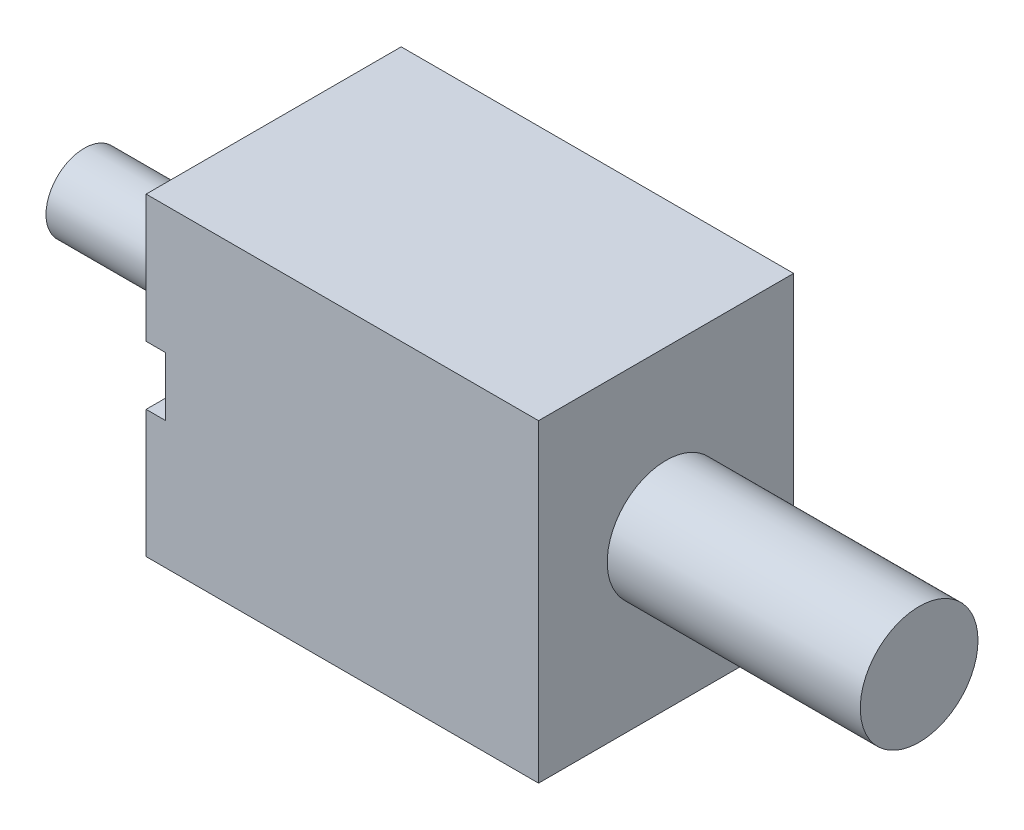
ISO-10303-21;
HEADER;
FILE_DESCRIPTION(('STEP AP214'),'2;1');
FILE_NAME('part.step','',(''),(''),'','','');
FILE_SCHEMA(('AUTOMOTIVE_DESIGN { 1 0 10303 214 1 1 1 1 }'));
ENDSEC;
DATA;
#1=APPLICATION_CONTEXT('core data for automotive mechanical design processes');
#2=APPLICATION_PROTOCOL_DEFINITION('international standard','automotive_design',2000,#1);
#3=PRODUCT_CONTEXT('',#1,'mechanical');
#4=PRODUCT('Part','Part','',(#3));
#5=PRODUCT_RELATED_PRODUCT_CATEGORY('part','',(#4));
#6=PRODUCT_DEFINITION_FORMATION('','',#4);
#7=PRODUCT_DEFINITION_CONTEXT('part definition',#1,'design');
#8=PRODUCT_DEFINITION('design','',#6,#7);
#9=PRODUCT_DEFINITION_SHAPE('','',#8);
#10=(LENGTH_UNIT() NAMED_UNIT(*) SI_UNIT(.MILLI.,.METRE.));
#11=(NAMED_UNIT(*) PLANE_ANGLE_UNIT() SI_UNIT($,.RADIAN.));
#12=(NAMED_UNIT(*) SI_UNIT($,.STERADIAN.) SOLID_ANGLE_UNIT());
#13=UNCERTAINTY_MEASURE_WITH_UNIT(LENGTH_MEASURE(1.E-05),#10,'distance_accuracy_value','');
#14=(GEOMETRIC_REPRESENTATION_CONTEXT(3) GLOBAL_UNCERTAINTY_ASSIGNED_CONTEXT((#13)) GLOBAL_UNIT_ASSIGNED_CONTEXT((#10,
#11,#12)) REPRESENTATION_CONTEXT('',''));
#15=CARTESIAN_POINT('',(0.,0.,0.));
#16=DIRECTION('',(0.,0.,1.));
#17=DIRECTION('',(1.,0.,0.));
#18=AXIS2_PLACEMENT_3D('',#15,#16,#17);
#19=CARTESIAN_POINT('',(10.,16.,6.5));
#20=DIRECTION('',(-1.,0.,0.));
#21=DIRECTION('',(0.,0.,1.));
#22=AXIS2_PLACEMENT_3D('',#19,#20,#21);
#23=PLANE('',#22);
#24=CARTESIAN_POINT('',(10.,8.,0.));
#25=DIRECTION('',(1.,0.,0.));
#26=DIRECTION('',(0.,0.,-1.));
#27=AXIS2_PLACEMENT_3D('',#24,#25,#26);
#28=CIRCLE('',#27,3.);
#29=CARTESIAN_POINT('',(10.,8.,-3.));
#30=VERTEX_POINT('',#29);
#31=EDGE_CURVE('E11',#30,#30,#28,.T.);
#32=ORIENTED_EDGE('',*,*,#31,.F.);
#33=EDGE_LOOP('',(#32));
#34=FACE_BOUND('',#33,.T.);
#35=DIRECTION('',(0.,0.,-1.));
#36=VECTOR('',#35,1.);
#37=CARTESIAN_POINT('',(10.,0.,6.5));
#38=LINE('',#37,#36);
#39=CARTESIAN_POINT('',(10.,0.,6.5));
#40=VERTEX_POINT('',#39);
#41=CARTESIAN_POINT('',(10.,0.,-6.5));
#42=VERTEX_POINT('',#41);
#43=EDGE_CURVE('E161',#40,#42,#38,.T.);
#44=ORIENTED_EDGE('',*,*,#43,.T.);
#45=DIRECTION('',(0.,-1.,0.));
#46=VECTOR('',#45,1.);
#47=CARTESIAN_POINT('',(10.,16.,-6.5));
#48=LINE('',#47,#46);
#49=CARTESIAN_POINT('',(10.,16.,-6.5));
#50=VERTEX_POINT('',#49);
#51=EDGE_CURVE('E46',#50,#42,#48,.T.);
#52=ORIENTED_EDGE('',*,*,#51,.F.);
#53=DIRECTION('',(0.,0.,-1.));
#54=VECTOR('',#53,1.);
#55=CARTESIAN_POINT('',(10.,16.,6.5));
#56=LINE('',#55,#54);
#57=CARTESIAN_POINT('',(10.,16.,6.5));
#58=VERTEX_POINT('',#57);
#59=EDGE_CURVE('E165',#58,#50,#56,.T.);
#60=ORIENTED_EDGE('',*,*,#59,.F.);
#61=DIRECTION('',(0.,-1.,0.));
#62=VECTOR('',#61,1.);
#63=CARTESIAN_POINT('',(10.,16.,6.5));
#64=LINE('',#63,#62);
#65=EDGE_CURVE('E175',#58,#40,#64,.T.);
#66=ORIENTED_EDGE('',*,*,#65,.T.);
#67=EDGE_LOOP('',(#44,#52,#60,#66));
#68=FACE_BOUND('',#67,.T.);
#69=ADVANCED_FACE('F43',(#34,#68),#23,.F.);
#70=CARTESIAN_POINT('',(-10.,16.,-6.5));
#71=DIRECTION('',(0.,0.,1.));
#72=DIRECTION('',(1.,0.,0.));
#73=AXIS2_PLACEMENT_3D('',#70,#71,#72);
#74=PLANE('',#73);
#75=DIRECTION('',(-1.,0.,0.));
#76=VECTOR('',#75,1.);
#77=CARTESIAN_POINT('',(-10.,0.,-6.5));
#78=LINE('',#77,#76);
#79=CARTESIAN_POINT('',(-10.,0.,-6.5));
#80=VERTEX_POINT('',#79);
#81=EDGE_CURVE('E179',#42,#80,#78,.T.);
#82=ORIENTED_EDGE('',*,*,#81,.T.);
#83=DIRECTION('',(0.,-1.,0.));
#84=VECTOR('',#83,1.);
#85=CARTESIAN_POINT('',(-10.,16.,-6.5));
#86=LINE('',#85,#84);
#87=CARTESIAN_POINT('',(-10.,16.,-6.5));
#88=VERTEX_POINT('',#87);
#89=EDGE_CURVE('E192',#88,#80,#86,.T.);
#90=ORIENTED_EDGE('',*,*,#89,.F.);
#91=DIRECTION('',(-1.,0.,0.));
#92=VECTOR('',#91,1.);
#93=CARTESIAN_POINT('',(-10.,16.,-6.5));
#94=LINE('',#93,#92);
#95=EDGE_CURVE('E97',#50,#88,#94,.T.);
#96=ORIENTED_EDGE('',*,*,#95,.F.);
#97=ORIENTED_EDGE('',*,*,#51,.T.);
#98=EDGE_LOOP('',(#82,#90,#96,#97));
#99=FACE_BOUND('',#98,.T.);
#100=ADVANCED_FACE('F199',(#99),#74,.F.);
#101=CARTESIAN_POINT('',(-10.,16.,6.5));
#102=DIRECTION('',(1.,0.,0.));
#103=DIRECTION('',(0.,0.,-1.));
#104=AXIS2_PLACEMENT_3D('',#101,#102,#103);
#105=PLANE('',#104);
#106=CARTESIAN_POINT('',(-10.,8.,0.));
#107=DIRECTION('',(-1.,0.,0.));
#108=DIRECTION('',(0.,0.,1.));
#109=AXIS2_PLACEMENT_3D('',#106,#107,#108);
#110=CIRCLE('',#109,1.95);
#111=CARTESIAN_POINT('',(-10.,8.,1.95));
#112=VERTEX_POINT('',#111);
#113=EDGE_CURVE('E52',#112,#112,#110,.T.);
#114=ORIENTED_EDGE('',*,*,#113,.F.);
#115=EDGE_LOOP('',(#114));
#116=FACE_BOUND('',#115,.T.);
#117=DIRECTION('',(0.,-1.,0.));
#118=VECTOR('',#117,1.);
#119=CARTESIAN_POINT('',(-10.,9.5,5.5));
#120=LINE('',#119,#118);
#121=CARTESIAN_POINT('',(-10.,9.5,5.5));
#122=VERTEX_POINT('',#121);
#123=CARTESIAN_POINT('',(-10.,6.5,5.5));
#124=VERTEX_POINT('',#123);
#125=EDGE_CURVE('E127',#122,#124,#120,.T.);
#126=ORIENTED_EDGE('',*,*,#125,.F.);
#127=DIRECTION('',(0.,0.,1.));
#128=VECTOR('',#127,1.);
#129=CARTESIAN_POINT('',(-10.,9.5,5.5));
#130=LINE('',#129,#128);
#131=CARTESIAN_POINT('',(-10.,9.5,6.5));
#132=VERTEX_POINT('',#131);
#133=EDGE_CURVE('E156',#122,#132,#130,.T.);
#134=ORIENTED_EDGE('',*,*,#133,.T.);
#135=DIRECTION('',(0.,-1.,0.));
#136=VECTOR('',#135,1.);
#137=CARTESIAN_POINT('',(-10.,16.,6.5));
#138=LINE('',#137,#136);
#139=CARTESIAN_POINT('',(-10.,16.,6.5));
#140=VERTEX_POINT('',#139);
#141=EDGE_CURVE('E189',#140,#132,#138,.T.);
#142=ORIENTED_EDGE('',*,*,#141,.F.);
#143=DIRECTION('',(0.,0.,1.));
#144=VECTOR('',#143,1.);
#145=CARTESIAN_POINT('',(-10.,16.,6.5));
#146=LINE('',#145,#144);
#147=EDGE_CURVE('E170',#88,#140,#146,.T.);
#148=ORIENTED_EDGE('',*,*,#147,.F.);
#149=ORIENTED_EDGE('',*,*,#89,.T.);
#150=DIRECTION('',(0.,0.,1.));
#151=VECTOR('',#150,1.);
#152=CARTESIAN_POINT('',(-10.,0.,6.5));
#153=LINE('',#152,#151);
#154=CARTESIAN_POINT('',(-10.,0.,6.5));
#155=VERTEX_POINT('',#154);
#156=EDGE_CURVE('E182',#80,#155,#153,.T.);
#157=ORIENTED_EDGE('',*,*,#156,.T.);
#158=CARTESIAN_POINT('',(-10.,6.5,6.5));
#159=VERTEX_POINT('',#158);
#160=EDGE_CURVE('E142',#159,#155,#138,.T.);
#161=ORIENTED_EDGE('',*,*,#160,.F.);
#162=DIRECTION('',(0.,0.,1.));
#163=VECTOR('',#162,1.);
#164=CARTESIAN_POINT('',(-10.,6.5,5.5));
#165=LINE('',#164,#163);
#166=EDGE_CURVE('E60',#124,#159,#165,.T.);
#167=ORIENTED_EDGE('',*,*,#166,.F.);
#168=EDGE_LOOP('',(#126,#134,#142,#148,#149,#157,#161,#167));
#169=FACE_BOUND('',#168,.T.);
#170=ADVANCED_FACE('F140',(#116,#169),#105,.F.);
#171=CARTESIAN_POINT('',(-10.,16.,6.5));
#172=DIRECTION('',(0.,0.,-1.));
#173=DIRECTION('',(-1.,0.,0.));
#174=AXIS2_PLACEMENT_3D('',#171,#172,#173);
#175=PLANE('',#174);
#176=ORIENTED_EDGE('',*,*,#141,.T.);
#177=DIRECTION('',(-1.,0.,0.));
#178=VECTOR('',#177,1.);
#179=CARTESIAN_POINT('',(-10.,9.5,6.5));
#180=LINE('',#179,#178);
#181=CARTESIAN_POINT('',(-9.,9.5,6.5));
#182=VERTEX_POINT('',#181);
#183=EDGE_CURVE('E137',#182,#132,#180,.T.);
#184=ORIENTED_EDGE('',*,*,#183,.F.);
#185=DIRECTION('',(0.,1.,0.));
#186=VECTOR('',#185,1.);
#187=CARTESIAN_POINT('',(-9.,9.5,6.5));
#188=LINE('',#187,#186);
#189=CARTESIAN_POINT('',(-9.,6.5,6.5));
#190=VERTEX_POINT('',#189);
#191=EDGE_CURVE('E371',#190,#182,#188,.T.);
#192=ORIENTED_EDGE('',*,*,#191,.F.);
#193=DIRECTION('',(1.,0.,0.));
#194=VECTOR('',#193,1.);
#195=CARTESIAN_POINT('',(-10.,6.5,6.5));
#196=LINE('',#195,#194);
#197=EDGE_CURVE('E375',#159,#190,#196,.T.);
#198=ORIENTED_EDGE('',*,*,#197,.F.);
#199=ORIENTED_EDGE('',*,*,#160,.T.);
#200=DIRECTION('',(1.,0.,0.));
#201=VECTOR('',#200,1.);
#202=CARTESIAN_POINT('',(-10.,0.,6.5));
#203=LINE('',#202,#201);
#204=EDGE_CURVE('E89',#155,#40,#203,.T.);
#205=ORIENTED_EDGE('',*,*,#204,.T.);
#206=ORIENTED_EDGE('',*,*,#65,.F.);
#207=DIRECTION('',(1.,0.,0.));
#208=VECTOR('',#207,1.);
#209=CARTESIAN_POINT('',(-10.,16.,6.5));
#210=LINE('',#209,#208);
#211=EDGE_CURVE('E69',#140,#58,#210,.T.);
#212=ORIENTED_EDGE('',*,*,#211,.F.);
#213=EDGE_LOOP('',(#176,#184,#192,#198,#199,#205,#206,#212));
#214=FACE_BOUND('',#213,.T.);
#215=ADVANCED_FACE('F216',(#214),#175,.F.);
#216=CARTESIAN_POINT('',(0.,16.,0.));
#217=DIRECTION('',(0.,-1.,0.));
#218=DIRECTION('',(0.,0.,-1.));
#219=AXIS2_PLACEMENT_3D('',#216,#217,#218);
#220=PLANE('',#219);
#221=ORIENTED_EDGE('',*,*,#59,.T.);
#222=ORIENTED_EDGE('',*,*,#95,.T.);
#223=ORIENTED_EDGE('',*,*,#147,.T.);
#224=ORIENTED_EDGE('',*,*,#211,.T.);
#225=EDGE_LOOP('',(#221,#222,#223,#224));
#226=FACE_BOUND('',#225,.T.);
#227=ADVANCED_FACE('F207',(#226),#220,.F.);
#228=CARTESIAN_POINT('',(0.,0.,0.));
#229=DIRECTION('',(0.,-1.,0.));
#230=DIRECTION('',(0.,0.,-1.));
#231=AXIS2_PLACEMENT_3D('',#228,#229,#230);
#232=PLANE('',#231);
#233=ORIENTED_EDGE('',*,*,#43,.F.);
#234=ORIENTED_EDGE('',*,*,#204,.F.);
#235=ORIENTED_EDGE('',*,*,#156,.F.);
#236=ORIENTED_EDGE('',*,*,#81,.F.);
#237=EDGE_LOOP('',(#233,#234,#235,#236));
#238=FACE_BOUND('',#237,.T.);
#239=ADVANCED_FACE('F204',(#238),#232,.T.);
#240=CARTESIAN_POINT('',(-19.65250965251,8.,0.));
#241=DIRECTION('',(1.,0.,0.));
#242=DIRECTION('',(0.,0.,-1.));
#243=AXIS2_PLACEMENT_3D('',#240,#241,#242);
#244=CYLINDRICAL_SURFACE('',#243,1.95);
#245=CARTESIAN_POINT('',(-19.65250965251,8.,0.));
#246=DIRECTION('',(-1.,0.,0.));
#247=DIRECTION('',(0.,0.,1.));
#248=AXIS2_PLACEMENT_3D('',#245,#246,#247);
#249=CIRCLE('',#248,1.95);
#250=CARTESIAN_POINT('',(-19.65250965251,8.,1.95));
#251=VERTEX_POINT('',#250);
#252=EDGE_CURVE('E155',#251,#251,#249,.T.);
#253=ORIENTED_EDGE('',*,*,#252,.F.);
#254=EDGE_LOOP('',(#253));
#255=FACE_BOUND('',#254,.T.);
#256=ORIENTED_EDGE('',*,*,#113,.T.);
#257=EDGE_LOOP('',(#256));
#258=FACE_BOUND('',#257,.T.);
#259=ADVANCED_FACE('F206',(#255,#258),#244,.T.);
#260=CARTESIAN_POINT('',(-19.65250965251,8.,0.));
#261=DIRECTION('',(-1.,0.,0.));
#262=DIRECTION('',(0.,0.,1.));
#263=AXIS2_PLACEMENT_3D('',#260,#261,#262);
#264=PLANE('',#263);
#265=ORIENTED_EDGE('',*,*,#252,.T.);
#266=EDGE_LOOP('',(#265));
#267=FACE_BOUND('',#266,.T.);
#268=ADVANCED_FACE('F213',(#267),#264,.T.);
#269=CARTESIAN_POINT('',(22.8957528958,8.,0.));
#270=DIRECTION('',(-1.,0.,0.));
#271=DIRECTION('',(0.,0.,1.));
#272=AXIS2_PLACEMENT_3D('',#269,#270,#271);
#273=CYLINDRICAL_SURFACE('',#272,3.);
#274=CARTESIAN_POINT('',(22.8957528958,8.,0.));
#275=DIRECTION('',(1.,0.,0.));
#276=DIRECTION('',(0.,0.,-1.));
#277=AXIS2_PLACEMENT_3D('',#274,#275,#276);
#278=CIRCLE('',#277,3.);
#279=CARTESIAN_POINT('',(22.8957528958,8.,-3.));
#280=VERTEX_POINT('',#279);
#281=EDGE_CURVE('E152',#280,#280,#278,.T.);
#282=ORIENTED_EDGE('',*,*,#281,.F.);
#283=EDGE_LOOP('',(#282));
#284=FACE_BOUND('',#283,.T.);
#285=ORIENTED_EDGE('',*,*,#31,.T.);
#286=EDGE_LOOP('',(#285));
#287=FACE_BOUND('',#286,.T.);
#288=ADVANCED_FACE('F228',(#284,#287),#273,.T.);
#289=CARTESIAN_POINT('',(22.8957528958,8.,0.));
#290=DIRECTION('',(1.,0.,0.));
#291=DIRECTION('',(0.,0.,-1.));
#292=AXIS2_PLACEMENT_3D('',#289,#290,#291);
#293=PLANE('',#292);
#294=ORIENTED_EDGE('',*,*,#281,.T.);
#295=EDGE_LOOP('',(#294));
#296=FACE_BOUND('',#295,.T.);
#297=ADVANCED_FACE('F230',(#296),#293,.T.);
#298=CARTESIAN_POINT('',(-10.,9.5,5.5));
#299=DIRECTION('',(0.,1.,0.));
#300=DIRECTION('',(-1.,0.,0.));
#301=AXIS2_PLACEMENT_3D('',#298,#299,#300);
#302=PLANE('',#301);
#303=ORIENTED_EDGE('',*,*,#183,.T.);
#304=ORIENTED_EDGE('',*,*,#133,.F.);
#305=DIRECTION('',(-1.,0.,0.));
#306=VECTOR('',#305,1.);
#307=CARTESIAN_POINT('',(-10.,9.5,5.5));
#308=LINE('',#307,#306);
#309=CARTESIAN_POINT('',(-9.,9.5,5.5));
#310=VERTEX_POINT('',#309);
#311=EDGE_CURVE('E133',#310,#122,#308,.T.);
#312=ORIENTED_EDGE('',*,*,#311,.F.);
#313=DIRECTION('',(0.,0.,1.));
#314=VECTOR('',#313,1.);
#315=CARTESIAN_POINT('',(-9.,9.5,5.5));
#316=LINE('',#315,#314);
#317=EDGE_CURVE('E147',#310,#182,#316,.T.);
#318=ORIENTED_EDGE('',*,*,#317,.T.);
#319=EDGE_LOOP('',(#303,#304,#312,#318));
#320=FACE_BOUND('',#319,.T.);
#321=ADVANCED_FACE('F236',(#320),#302,.F.);
#322=CARTESIAN_POINT('',(-9.,9.5,5.5));
#323=DIRECTION('',(1.,0.,0.));
#324=DIRECTION('',(0.,0.,-1.));
#325=AXIS2_PLACEMENT_3D('',#322,#323,#324);
#326=PLANE('',#325);
#327=ORIENTED_EDGE('',*,*,#191,.T.);
#328=ORIENTED_EDGE('',*,*,#317,.F.);
#329=DIRECTION('',(0.,1.,0.));
#330=VECTOR('',#329,1.);
#331=CARTESIAN_POINT('',(-9.,9.5,5.5));
#332=LINE('',#331,#330);
#333=CARTESIAN_POINT('',(-9.,6.5,5.5));
#334=VERTEX_POINT('',#333);
#335=EDGE_CURVE('E126',#334,#310,#332,.T.);
#336=ORIENTED_EDGE('',*,*,#335,.F.);
#337=DIRECTION('',(0.,0.,1.));
#338=VECTOR('',#337,1.);
#339=CARTESIAN_POINT('',(-9.,6.5,5.5));
#340=LINE('',#339,#338);
#341=EDGE_CURVE('E121',#334,#190,#340,.T.);
#342=ORIENTED_EDGE('',*,*,#341,.T.);
#343=EDGE_LOOP('',(#327,#328,#336,#342));
#344=FACE_BOUND('',#343,.T.);
#345=ADVANCED_FACE('F245',(#344),#326,.F.);
#346=CARTESIAN_POINT('',(-10.,6.5,5.5));
#347=DIRECTION('',(0.,-1.,0.));
#348=DIRECTION('',(0.,0.,-1.));
#349=AXIS2_PLACEMENT_3D('',#346,#347,#348);
#350=PLANE('',#349);
#351=ORIENTED_EDGE('',*,*,#197,.T.);
#352=ORIENTED_EDGE('',*,*,#341,.F.);
#353=DIRECTION('',(1.,0.,0.));
#354=VECTOR('',#353,1.);
#355=CARTESIAN_POINT('',(-10.,6.5,5.5));
#356=LINE('',#355,#354);
#357=EDGE_CURVE('E118',#124,#334,#356,.T.);
#358=ORIENTED_EDGE('',*,*,#357,.F.);
#359=ORIENTED_EDGE('',*,*,#166,.T.);
#360=EDGE_LOOP('',(#351,#352,#358,#359));
#361=FACE_BOUND('',#360,.T.);
#362=ADVANCED_FACE('F120',(#361),#350,.F.);
#363=CARTESIAN_POINT('',(0.,0.,5.5));
#364=DIRECTION('',(0.,0.,1.));
#365=DIRECTION('',(1.,0.,0.));
#366=AXIS2_PLACEMENT_3D('',#363,#364,#365);
#367=PLANE('',#366);
#368=ORIENTED_EDGE('',*,*,#125,.T.);
#369=ORIENTED_EDGE('',*,*,#357,.T.);
#370=ORIENTED_EDGE('',*,*,#335,.T.);
#371=ORIENTED_EDGE('',*,*,#311,.T.);
#372=EDGE_LOOP('',(#368,#369,#370,#371));
#373=FACE_BOUND('',#372,.T.);
#374=ADVANCED_FACE('F131',(#373),#367,.T.);
#375=CLOSED_SHELL('',(#69,#100,#170,#215,#227,#239,#259,#268,#288,#297,#321,#345,#362,#374));
#376=MANIFOLD_SOLID_BREP('B2',#375);
#377=ADVANCED_BREP_SHAPE_REPRESENTATION('',(#18,#376),#14);
#378=SHAPE_DEFINITION_REPRESENTATION(#9,#377);
ENDSEC;
END-ISO-10303-21;
